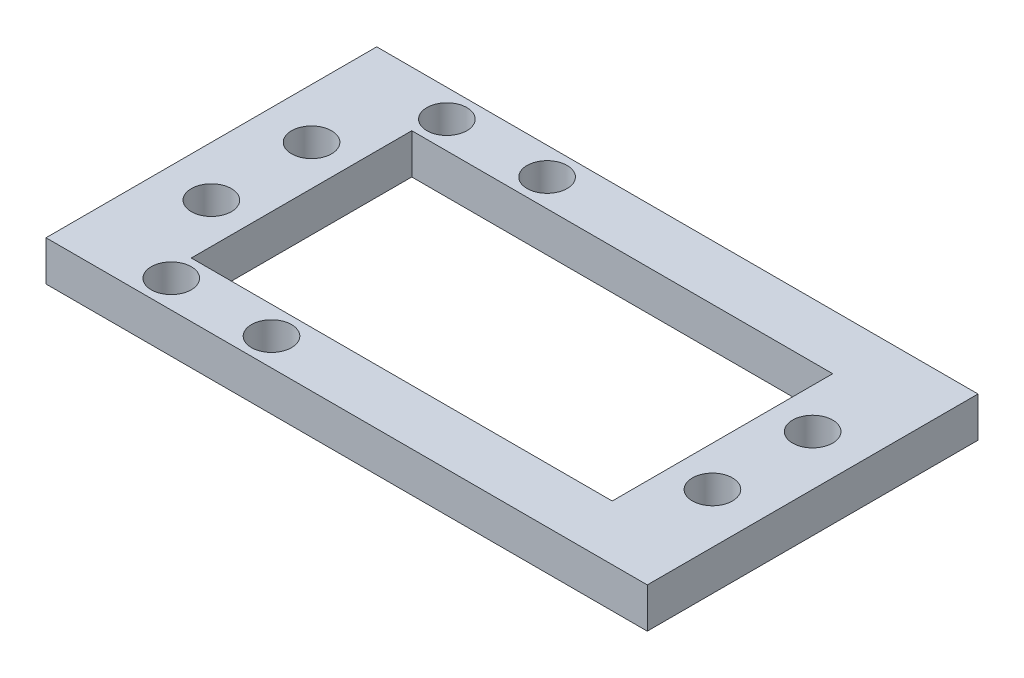
ISO-10303-21;
HEADER;
FILE_DESCRIPTION(('STEP AP214'),'2;1');
FILE_NAME('part.step','',(''),(''),'','','');
FILE_SCHEMA(('AUTOMOTIVE_DESIGN { 1 0 10303 214 1 1 1 1 }'));
ENDSEC;
DATA;
#1=APPLICATION_CONTEXT('core data for automotive mechanical design processes');
#2=APPLICATION_PROTOCOL_DEFINITION('international standard','automotive_design',2000,#1);
#3=PRODUCT_CONTEXT('',#1,'mechanical');
#4=PRODUCT('Part','Part','',(#3));
#5=PRODUCT_RELATED_PRODUCT_CATEGORY('part','',(#4));
#6=PRODUCT_DEFINITION_FORMATION('','',#4);
#7=PRODUCT_DEFINITION_CONTEXT('part definition',#1,'design');
#8=PRODUCT_DEFINITION('design','',#6,#7);
#9=PRODUCT_DEFINITION_SHAPE('','',#8);
#10=(LENGTH_UNIT() NAMED_UNIT(*) SI_UNIT(.MILLI.,.METRE.));
#11=(NAMED_UNIT(*) PLANE_ANGLE_UNIT() SI_UNIT($,.RADIAN.));
#12=(NAMED_UNIT(*) SI_UNIT($,.STERADIAN.) SOLID_ANGLE_UNIT());
#13=UNCERTAINTY_MEASURE_WITH_UNIT(LENGTH_MEASURE(1.E-05),#10,'distance_accuracy_value','');
#14=(GEOMETRIC_REPRESENTATION_CONTEXT(3) GLOBAL_UNCERTAINTY_ASSIGNED_CONTEXT((#13)) GLOBAL_UNIT_ASSIGNED_CONTEXT((#10,
#11,#12)) REPRESENTATION_CONTEXT('',''));
#15=CARTESIAN_POINT('',(0.,0.,0.));
#16=DIRECTION('',(0.,0.,1.));
#17=DIRECTION('',(1.,0.,0.));
#18=AXIS2_PLACEMENT_3D('',#15,#16,#17);
#19=CARTESIAN_POINT('',(32.3540830425261,17.9987562189055,9.));
#20=DIRECTION('',(1.,0.,0.));
#21=DIRECTION('',(0.,0.,-1.));
#22=AXIS2_PLACEMENT_3D('',#19,#20,#21);
#23=PLANE('',#22);
#24=DIRECTION('',(0.,1.,0.));
#25=VECTOR('',#24,1.);
#26=CARTESIAN_POINT('',(32.3540830425261,17.9987562189055,9.));
#27=LINE('',#26,#25);
#28=CARTESIAN_POINT('',(32.3540830425261,27.9987562189055,9.));
#29=VERTEX_POINT('',#28);
#30=CARTESIAN_POINT('',(32.3540830425261,31.9987562189055,9.));
#31=VERTEX_POINT('',#30);
#32=EDGE_CURVE('E42',#29,#31,#27,.T.);
#33=ORIENTED_EDGE('',*,*,#32,.F.);
#34=DIRECTION('',(0.,0.,1.));
#35=VECTOR('',#34,1.);
#36=CARTESIAN_POINT('',(32.3540830425261,27.9987562189055,9.));
#37=LINE('',#36,#35);
#38=CARTESIAN_POINT('',(32.3540830425261,27.9987562189055,31.));
#39=VERTEX_POINT('',#38);
#40=EDGE_CURVE('E56',#29,#39,#37,.T.);
#41=ORIENTED_EDGE('',*,*,#40,.T.);
#42=DIRECTION('',(0.,1.,0.));
#43=VECTOR('',#42,1.);
#44=CARTESIAN_POINT('',(32.3540830425261,17.9987562189055,31.));
#45=LINE('',#44,#43);
#46=CARTESIAN_POINT('',(32.3540830425261,31.9987562189055,31.));
#47=VERTEX_POINT('',#46);
#48=EDGE_CURVE('E11',#39,#47,#45,.T.);
#49=ORIENTED_EDGE('',*,*,#48,.T.);
#50=DIRECTION('',(0.,0.,-1.));
#51=VECTOR('',#50,1.);
#52=CARTESIAN_POINT('',(32.3540830425261,31.9987562189055,31.));
#53=LINE('',#52,#51);
#54=EDGE_CURVE('E162',#47,#31,#53,.T.);
#55=ORIENTED_EDGE('',*,*,#54,.T.);
#56=EDGE_LOOP('',(#33,#41,#49,#55));
#57=FACE_BOUND('',#56,.T.);
#58=ADVANCED_FACE('F39',(#57),#23,.F.);
#59=CARTESIAN_POINT('',(-9.64591695747391,17.9987562189055,31.));
#60=DIRECTION('',(0.,0.,1.));
#61=DIRECTION('',(1.,0.,0.));
#62=AXIS2_PLACEMENT_3D('',#59,#60,#61);
#63=PLANE('',#62);
#64=ORIENTED_EDGE('',*,*,#48,.F.);
#65=DIRECTION('',(-1.,0.,0.));
#66=VECTOR('',#65,1.);
#67=CARTESIAN_POINT('',(-9.64591695747391,27.9987562189055,31.));
#68=LINE('',#67,#66);
#69=CARTESIAN_POINT('',(-9.64591695747391,27.9987562189055,31.));
#70=VERTEX_POINT('',#69);
#71=EDGE_CURVE('E292',#39,#70,#68,.T.);
#72=ORIENTED_EDGE('',*,*,#71,.T.);
#73=DIRECTION('',(0.,1.,0.));
#74=VECTOR('',#73,1.);
#75=CARTESIAN_POINT('',(-9.64591695747391,17.9987562189055,31.));
#76=LINE('',#75,#74);
#77=CARTESIAN_POINT('',(-9.64591695747391,31.9987562189055,31.));
#78=VERTEX_POINT('',#77);
#79=EDGE_CURVE('E48',#70,#78,#76,.T.);
#80=ORIENTED_EDGE('',*,*,#79,.T.);
#81=DIRECTION('',(1.,0.,0.));
#82=VECTOR('',#81,1.);
#83=CARTESIAN_POINT('',(-9.64591695747391,31.9987562189055,31.));
#84=LINE('',#83,#82);
#85=EDGE_CURVE('E166',#78,#47,#84,.T.);
#86=ORIENTED_EDGE('',*,*,#85,.T.);
#87=EDGE_LOOP('',(#64,#72,#80,#86));
#88=FACE_BOUND('',#87,.T.);
#89=ADVANCED_FACE('F220',(#88),#63,.F.);
#90=CARTESIAN_POINT('',(-9.64591695747391,17.9987562189055,9.));
#91=DIRECTION('',(-1.,0.,0.));
#92=DIRECTION('',(0.,0.,1.));
#93=AXIS2_PLACEMENT_3D('',#90,#91,#92);
#94=PLANE('',#93);
#95=ORIENTED_EDGE('',*,*,#79,.F.);
#96=DIRECTION('',(0.,0.,-1.));
#97=VECTOR('',#96,1.);
#98=CARTESIAN_POINT('',(-9.64591695747391,27.9987562189055,9.));
#99=LINE('',#98,#97);
#100=CARTESIAN_POINT('',(-9.64591695747391,27.9987562189055,9.));
#101=VERTEX_POINT('',#100);
#102=EDGE_CURVE('E296',#70,#101,#99,.T.);
#103=ORIENTED_EDGE('',*,*,#102,.T.);
#104=DIRECTION('',(0.,1.,0.));
#105=VECTOR('',#104,1.);
#106=CARTESIAN_POINT('',(-9.64591695747391,17.9987562189055,9.));
#107=LINE('',#106,#105);
#108=CARTESIAN_POINT('',(-9.64591695747391,31.9987562189055,9.));
#109=VERTEX_POINT('',#108);
#110=EDGE_CURVE('E146',#101,#109,#107,.T.);
#111=ORIENTED_EDGE('',*,*,#110,.T.);
#112=DIRECTION('',(0.,0.,1.));
#113=VECTOR('',#112,1.);
#114=CARTESIAN_POINT('',(-9.64591695747391,31.9987562189055,31.));
#115=LINE('',#114,#113);
#116=EDGE_CURVE('E170',#109,#78,#115,.T.);
#117=ORIENTED_EDGE('',*,*,#116,.T.);
#118=EDGE_LOOP('',(#95,#103,#111,#117));
#119=FACE_BOUND('',#118,.T.);
#120=ADVANCED_FACE('F224',(#119),#94,.F.);
#121=CARTESIAN_POINT('',(-9.64591695747391,17.9987562189055,9.));
#122=DIRECTION('',(0.,0.,-1.));
#123=DIRECTION('',(-1.,0.,0.));
#124=AXIS2_PLACEMENT_3D('',#121,#122,#123);
#125=PLANE('',#124);
#126=ORIENTED_EDGE('',*,*,#110,.F.);
#127=DIRECTION('',(1.,0.,0.));
#128=VECTOR('',#127,1.);
#129=CARTESIAN_POINT('',(-9.64591695747391,27.9987562189055,9.));
#130=LINE('',#129,#128);
#131=EDGE_CURVE('E160',#101,#29,#130,.T.);
#132=ORIENTED_EDGE('',*,*,#131,.T.);
#133=ORIENTED_EDGE('',*,*,#32,.T.);
#134=DIRECTION('',(-1.,0.,0.));
#135=VECTOR('',#134,1.);
#136=CARTESIAN_POINT('',(-9.64591695747391,31.9987562189055,9.));
#137=LINE('',#136,#135);
#138=EDGE_CURVE('E158',#31,#109,#137,.T.);
#139=ORIENTED_EDGE('',*,*,#138,.T.);
#140=EDGE_LOOP('',(#126,#132,#133,#139));
#141=FACE_BOUND('',#140,.T.);
#142=ADVANCED_FACE('F156',(#141),#125,.F.);
#143=CARTESIAN_POINT('',(-13.6459169574739,17.9987562189055,15.));
#144=DIRECTION('',(0.,1.,0.));
#145=DIRECTION('',(0.,0.,1.));
#146=AXIS2_PLACEMENT_3D('',#143,#144,#145);
#147=CYLINDRICAL_SURFACE('',#146,2.);
#148=CARTESIAN_POINT('',(-13.6459169574739,27.9987562189055,15.));
#149=DIRECTION('',(0.,1.,0.));
#150=DIRECTION('',(0.,0.,1.));
#151=AXIS2_PLACEMENT_3D('',#148,#149,#150);
#152=CIRCLE('',#151,2.);
#153=CARTESIAN_POINT('',(-13.6459169574739,27.9987562189055,17.));
#154=VERTEX_POINT('',#153);
#155=EDGE_CURVE('E248',#154,#154,#152,.F.);
#156=ORIENTED_EDGE('',*,*,#155,.T.);
#157=EDGE_LOOP('',(#156));
#158=FACE_BOUND('',#157,.T.);
#159=CARTESIAN_POINT('',(-13.6459169574739,31.9987562189055,15.));
#160=DIRECTION('',(0.,1.,0.));
#161=DIRECTION('',(0.,0.,1.));
#162=AXIS2_PLACEMENT_3D('',#159,#160,#161);
#163=CIRCLE('',#162,2.);
#164=CARTESIAN_POINT('',(-13.6459169574739,31.9987562189055,17.));
#165=VERTEX_POINT('',#164);
#166=EDGE_CURVE('E251',#165,#165,#163,.T.);
#167=ORIENTED_EDGE('',*,*,#166,.T.);
#168=EDGE_LOOP('',(#167));
#169=FACE_BOUND('',#168,.T.);
#170=ADVANCED_FACE('F232',(#158,#169),#147,.F.);
#171=CARTESIAN_POINT('',(36.3540830425261,17.9987562189055,25.));
#172=DIRECTION('',(0.,1.,0.));
#173=DIRECTION('',(0.,0.,1.));
#174=AXIS2_PLACEMENT_3D('',#171,#172,#173);
#175=CYLINDRICAL_SURFACE('',#174,2.);
#176=CARTESIAN_POINT('',(36.3540830425261,27.9987562189055,25.));
#177=DIRECTION('',(0.,1.,0.));
#178=DIRECTION('',(0.,0.,1.));
#179=AXIS2_PLACEMENT_3D('',#176,#177,#178);
#180=CIRCLE('',#179,2.);
#181=CARTESIAN_POINT('',(36.3540830425261,27.9987562189055,27.));
#182=VERTEX_POINT('',#181);
#183=EDGE_CURVE('E352',#182,#182,#180,.F.);
#184=ORIENTED_EDGE('',*,*,#183,.T.);
#185=EDGE_LOOP('',(#184));
#186=FACE_BOUND('',#185,.T.);
#187=CARTESIAN_POINT('',(36.3540830425261,31.9987562189055,25.));
#188=DIRECTION('',(0.,1.,0.));
#189=DIRECTION('',(0.,0.,1.));
#190=AXIS2_PLACEMENT_3D('',#187,#188,#189);
#191=CIRCLE('',#190,2.);
#192=CARTESIAN_POINT('',(36.3540830425261,31.9987562189055,27.));
#193=VERTEX_POINT('',#192);
#194=EDGE_CURVE('E271',#193,#193,#191,.T.);
#195=ORIENTED_EDGE('',*,*,#194,.T.);
#196=EDGE_LOOP('',(#195));
#197=FACE_BOUND('',#196,.T.);
#198=ADVANCED_FACE('F238',(#186,#197),#175,.F.);
#199=CARTESIAN_POINT('',(36.3540830425261,17.9987562189055,15.));
#200=DIRECTION('',(0.,1.,0.));
#201=DIRECTION('',(0.,0.,1.));
#202=AXIS2_PLACEMENT_3D('',#199,#200,#201);
#203=CYLINDRICAL_SURFACE('',#202,2.);
#204=CARTESIAN_POINT('',(36.3540830425261,27.9987562189055,15.));
#205=DIRECTION('',(0.,1.,0.));
#206=DIRECTION('',(0.,0.,1.));
#207=AXIS2_PLACEMENT_3D('',#204,#205,#206);
#208=CIRCLE('',#207,2.);
#209=CARTESIAN_POINT('',(36.3540830425261,27.9987562189055,17.));
#210=VERTEX_POINT('',#209);
#211=EDGE_CURVE('E357',#210,#210,#208,.F.);
#212=ORIENTED_EDGE('',*,*,#211,.T.);
#213=EDGE_LOOP('',(#212));
#214=FACE_BOUND('',#213,.T.);
#215=CARTESIAN_POINT('',(36.3540830425261,31.9987562189055,15.));
#216=DIRECTION('',(0.,1.,0.));
#217=DIRECTION('',(0.,0.,1.));
#218=AXIS2_PLACEMENT_3D('',#215,#216,#217);
#219=CIRCLE('',#218,2.);
#220=CARTESIAN_POINT('',(36.3540830425261,31.9987562189055,17.));
#221=VERTEX_POINT('',#220);
#222=EDGE_CURVE('E263',#221,#221,#219,.T.);
#223=ORIENTED_EDGE('',*,*,#222,.T.);
#224=EDGE_LOOP('',(#223));
#225=FACE_BOUND('',#224,.T.);
#226=ADVANCED_FACE('F214',(#214,#225),#203,.F.);
#227=CARTESIAN_POINT('',(-13.6459169574739,17.9987562189055,25.));
#228=DIRECTION('',(0.,1.,0.));
#229=DIRECTION('',(0.,0.,1.));
#230=AXIS2_PLACEMENT_3D('',#227,#228,#229);
#231=CYLINDRICAL_SURFACE('',#230,2.);
#232=CARTESIAN_POINT('',(-13.6459169574739,27.9987562189055,25.));
#233=DIRECTION('',(0.,1.,0.));
#234=DIRECTION('',(0.,0.,1.));
#235=AXIS2_PLACEMENT_3D('',#232,#233,#234);
#236=CIRCLE('',#235,2.);
#237=CARTESIAN_POINT('',(-13.6459169574739,27.9987562189055,27.));
#238=VERTEX_POINT('',#237);
#239=EDGE_CURVE('E355',#238,#238,#236,.F.);
#240=ORIENTED_EDGE('',*,*,#239,.T.);
#241=EDGE_LOOP('',(#240));
#242=FACE_BOUND('',#241,.T.);
#243=CARTESIAN_POINT('',(-13.6459169574739,31.9987562189055,25.));
#244=DIRECTION('',(0.,1.,0.));
#245=DIRECTION('',(0.,0.,1.));
#246=AXIS2_PLACEMENT_3D('',#243,#244,#245);
#247=CIRCLE('',#246,2.);
#248=CARTESIAN_POINT('',(-13.6459169574739,31.9987562189055,27.));
#249=VERTEX_POINT('',#248);
#250=EDGE_CURVE('E255',#249,#249,#247,.T.);
#251=ORIENTED_EDGE('',*,*,#250,.T.);
#252=EDGE_LOOP('',(#251));
#253=FACE_BOUND('',#252,.T.);
#254=ADVANCED_FACE('F207',(#242,#253),#231,.F.);
#255=CARTESIAN_POINT('',(0.,31.9987562189055,0.));
#256=DIRECTION('',(0.,-1.,0.));
#257=DIRECTION('',(0.,0.,-1.));
#258=AXIS2_PLACEMENT_3D('',#255,#256,#257);
#259=PLANE('',#258);
#260=DIRECTION('',(0.,0.,-1.));
#261=VECTOR('',#260,1.);
#262=CARTESIAN_POINT('',(41.3540830425261,31.9987562189055,36.5));
#263=LINE('',#262,#261);
#264=CARTESIAN_POINT('',(41.3540830425261,31.9987562189055,36.5));
#265=VERTEX_POINT('',#264);
#266=CARTESIAN_POINT('',(41.3540830425261,31.9987562189055,3.5));
#267=VERTEX_POINT('',#266);
#268=EDGE_CURVE('E117',#265,#267,#263,.T.);
#269=ORIENTED_EDGE('',*,*,#268,.T.);
#270=DIRECTION('',(-1.,0.,0.));
#271=VECTOR('',#270,1.);
#272=CARTESIAN_POINT('',(-18.6459169574739,31.9987562189055,3.5));
#273=LINE('',#272,#271);
#274=CARTESIAN_POINT('',(-18.6459169574739,31.9987562189055,3.5));
#275=VERTEX_POINT('',#274);
#276=EDGE_CURVE('E188',#267,#275,#273,.T.);
#277=ORIENTED_EDGE('',*,*,#276,.T.);
#278=DIRECTION('',(0.,0.,1.));
#279=VECTOR('',#278,1.);
#280=CARTESIAN_POINT('',(-18.6459169574739,31.9987562189055,36.5));
#281=LINE('',#280,#279);
#282=CARTESIAN_POINT('',(-18.6459169574739,31.9987562189055,36.5));
#283=VERTEX_POINT('',#282);
#284=EDGE_CURVE('E191',#275,#283,#281,.T.);
#285=ORIENTED_EDGE('',*,*,#284,.T.);
#286=DIRECTION('',(1.,0.,0.));
#287=VECTOR('',#286,1.);
#288=CARTESIAN_POINT('',(-18.6459169574739,31.9987562189055,36.5));
#289=LINE('',#288,#287);
#290=EDGE_CURVE('E132',#283,#265,#289,.T.);
#291=ORIENTED_EDGE('',*,*,#290,.T.);
#292=EDGE_LOOP('',(#269,#277,#285,#291));
#293=FACE_BOUND('',#292,.T.);
#294=ORIENTED_EDGE('',*,*,#138,.F.);
#295=ORIENTED_EDGE('',*,*,#54,.F.);
#296=ORIENTED_EDGE('',*,*,#85,.F.);
#297=ORIENTED_EDGE('',*,*,#116,.F.);
#298=EDGE_LOOP('',(#294,#295,#296,#297));
#299=FACE_BOUND('',#298,.T.);
#300=CARTESIAN_POINT('',(-8.89591695747391,31.9987562189055,6.25));
#301=DIRECTION('',(0.,1.,0.));
#302=DIRECTION('',(0.,0.,1.));
#303=AXIS2_PLACEMENT_3D('',#300,#301,#302);
#304=CIRCLE('',#303,2.);
#305=CARTESIAN_POINT('',(-8.89591695747391,31.9987562189055,8.25));
#306=VERTEX_POINT('',#305);
#307=EDGE_CURVE('E172',#306,#306,#304,.T.);
#308=ORIENTED_EDGE('',*,*,#307,.F.);
#309=EDGE_LOOP('',(#308));
#310=FACE_BOUND('',#309,.T.);
#311=CARTESIAN_POINT('',(-8.89591695747391,31.9987562189055,33.75));
#312=DIRECTION('',(0.,1.,0.));
#313=DIRECTION('',(0.,0.,-1.));
#314=AXIS2_PLACEMENT_3D('',#311,#312,#313);
#315=CIRCLE('',#314,2.);
#316=CARTESIAN_POINT('',(-8.89591695747391,31.9987562189055,31.75));
#317=VERTEX_POINT('',#316);
#318=EDGE_CURVE('E178',#317,#317,#315,.T.);
#319=ORIENTED_EDGE('',*,*,#318,.F.);
#320=EDGE_LOOP('',(#319));
#321=FACE_BOUND('',#320,.T.);
#322=CARTESIAN_POINT('',(1.10408304252609,31.9987562189055,6.25));
#323=DIRECTION('',(0.,1.,0.));
#324=DIRECTION('',(0.,0.,1.));
#325=AXIS2_PLACEMENT_3D('',#322,#323,#324);
#326=CIRCLE('',#325,2.);
#327=CARTESIAN_POINT('',(1.10408304252609,31.9987562189055,8.25));
#328=VERTEX_POINT('',#327);
#329=EDGE_CURVE('E260',#328,#328,#326,.T.);
#330=ORIENTED_EDGE('',*,*,#329,.F.);
#331=EDGE_LOOP('',(#330));
#332=FACE_BOUND('',#331,.T.);
#333=CARTESIAN_POINT('',(1.10408304252609,31.9987562189055,33.75));
#334=DIRECTION('',(0.,1.,0.));
#335=DIRECTION('',(0.,0.,-1.));
#336=AXIS2_PLACEMENT_3D('',#333,#334,#335);
#337=CIRCLE('',#336,2.);
#338=CARTESIAN_POINT('',(1.10408304252609,31.9987562189055,31.75));
#339=VERTEX_POINT('',#338);
#340=EDGE_CURVE('E254',#339,#339,#337,.T.);
#341=ORIENTED_EDGE('',*,*,#340,.F.);
#342=EDGE_LOOP('',(#341));
#343=FACE_BOUND('',#342,.T.);
#344=ORIENTED_EDGE('',*,*,#166,.F.);
#345=EDGE_LOOP('',(#344));
#346=FACE_BOUND('',#345,.T.);
#347=ORIENTED_EDGE('',*,*,#250,.F.);
#348=EDGE_LOOP('',(#347));
#349=FACE_BOUND('',#348,.T.);
#350=ORIENTED_EDGE('',*,*,#222,.F.);
#351=EDGE_LOOP('',(#350));
#352=FACE_BOUND('',#351,.T.);
#353=ORIENTED_EDGE('',*,*,#194,.F.);
#354=EDGE_LOOP('',(#353));
#355=FACE_BOUND('',#354,.T.);
#356=ADVANCED_FACE('F168',(#293,#299,#310,#321,#332,#343,#346,#349,#352,#355),#259,.F.);
#357=CARTESIAN_POINT('',(41.3540830425261,31.9987562189055,36.5));
#358=DIRECTION('',(-1.,0.,0.));
#359=DIRECTION('',(0.,0.,1.));
#360=AXIS2_PLACEMENT_3D('',#357,#358,#359);
#361=PLANE('',#360);
#362=DIRECTION('',(0.,0.,-1.));
#363=VECTOR('',#362,1.);
#364=CARTESIAN_POINT('',(41.3540830425261,27.9987562189055,36.5));
#365=LINE('',#364,#363);
#366=CARTESIAN_POINT('',(41.3540830425261,27.9987562189055,36.5));
#367=VERTEX_POINT('',#366);
#368=CARTESIAN_POINT('',(41.3540830425261,27.9987562189055,3.5));
#369=VERTEX_POINT('',#368);
#370=EDGE_CURVE('E111',#367,#369,#365,.T.);
#371=ORIENTED_EDGE('',*,*,#370,.T.);
#372=DIRECTION('',(0.,-1.,0.));
#373=VECTOR('',#372,1.);
#374=CARTESIAN_POINT('',(41.3540830425261,31.9987562189055,3.5));
#375=LINE('',#374,#373);
#376=EDGE_CURVE('E138',#267,#369,#375,.T.);
#377=ORIENTED_EDGE('',*,*,#376,.F.);
#378=ORIENTED_EDGE('',*,*,#268,.F.);
#379=DIRECTION('',(0.,-1.,0.));
#380=VECTOR('',#379,1.);
#381=CARTESIAN_POINT('',(41.3540830425261,31.9987562189055,36.5));
#382=LINE('',#381,#380);
#383=EDGE_CURVE('E134',#265,#367,#382,.T.);
#384=ORIENTED_EDGE('',*,*,#383,.T.);
#385=EDGE_LOOP('',(#371,#377,#378,#384));
#386=FACE_BOUND('',#385,.T.);
#387=ADVANCED_FACE('F204',(#386),#361,.F.);
#388=CARTESIAN_POINT('',(-18.6459169574739,31.9987562189055,3.5));
#389=DIRECTION('',(0.,0.,1.));
#390=DIRECTION('',(1.,0.,0.));
#391=AXIS2_PLACEMENT_3D('',#388,#389,#390);
#392=PLANE('',#391);
#393=DIRECTION('',(-1.,0.,0.));
#394=VECTOR('',#393,1.);
#395=CARTESIAN_POINT('',(-18.6459169574739,27.9987562189055,3.5));
#396=LINE('',#395,#394);
#397=CARTESIAN_POINT('',(-18.6459169574739,27.9987562189055,3.5));
#398=VERTEX_POINT('',#397);
#399=EDGE_CURVE('E129',#369,#398,#396,.T.);
#400=ORIENTED_EDGE('',*,*,#399,.T.);
#401=DIRECTION('',(0.,-1.,0.));
#402=VECTOR('',#401,1.);
#403=CARTESIAN_POINT('',(-18.6459169574739,31.9987562189055,3.5));
#404=LINE('',#403,#402);
#405=EDGE_CURVE('E127',#275,#398,#404,.T.);
#406=ORIENTED_EDGE('',*,*,#405,.F.);
#407=ORIENTED_EDGE('',*,*,#276,.F.);
#408=ORIENTED_EDGE('',*,*,#376,.T.);
#409=EDGE_LOOP('',(#400,#406,#407,#408));
#410=FACE_BOUND('',#409,.T.);
#411=ADVANCED_FACE('F200',(#410),#392,.F.);
#412=CARTESIAN_POINT('',(-18.6459169574739,31.9987562189055,36.5));
#413=DIRECTION('',(1.,0.,0.));
#414=DIRECTION('',(0.,0.,-1.));
#415=AXIS2_PLACEMENT_3D('',#412,#413,#414);
#416=PLANE('',#415);
#417=DIRECTION('',(0.,0.,1.));
#418=VECTOR('',#417,1.);
#419=CARTESIAN_POINT('',(-18.6459169574739,27.9987562189055,36.5));
#420=LINE('',#419,#418);
#421=CARTESIAN_POINT('',(-18.6459169574739,27.9987562189055,36.5));
#422=VERTEX_POINT('',#421);
#423=EDGE_CURVE('E108',#398,#422,#420,.T.);
#424=ORIENTED_EDGE('',*,*,#423,.T.);
#425=DIRECTION('',(0.,-1.,0.));
#426=VECTOR('',#425,1.);
#427=CARTESIAN_POINT('',(-18.6459169574739,31.9987562189055,36.5));
#428=LINE('',#427,#426);
#429=EDGE_CURVE('E124',#283,#422,#428,.T.);
#430=ORIENTED_EDGE('',*,*,#429,.F.);
#431=ORIENTED_EDGE('',*,*,#284,.F.);
#432=ORIENTED_EDGE('',*,*,#405,.T.);
#433=EDGE_LOOP('',(#424,#430,#431,#432));
#434=FACE_BOUND('',#433,.T.);
#435=ADVANCED_FACE('F122',(#434),#416,.F.);
#436=CARTESIAN_POINT('',(-18.6459169574739,31.9987562189055,36.5));
#437=DIRECTION('',(0.,0.,-1.));
#438=DIRECTION('',(-1.,0.,0.));
#439=AXIS2_PLACEMENT_3D('',#436,#437,#438);
#440=PLANE('',#439);
#441=DIRECTION('',(1.,0.,0.));
#442=VECTOR('',#441,1.);
#443=CARTESIAN_POINT('',(-18.6459169574739,27.9987562189055,36.5));
#444=LINE('',#443,#442);
#445=EDGE_CURVE('E104',#422,#367,#444,.T.);
#446=ORIENTED_EDGE('',*,*,#445,.T.);
#447=ORIENTED_EDGE('',*,*,#383,.F.);
#448=ORIENTED_EDGE('',*,*,#290,.F.);
#449=ORIENTED_EDGE('',*,*,#429,.T.);
#450=EDGE_LOOP('',(#446,#447,#448,#449));
#451=FACE_BOUND('',#450,.T.);
#452=ADVANCED_FACE('F131',(#451),#440,.F.);
#453=CARTESIAN_POINT('',(-8.89591695747391,31.9987562189055,6.25));
#454=DIRECTION('',(0.,-1.,0.));
#455=DIRECTION('',(0.,0.,-1.));
#456=AXIS2_PLACEMENT_3D('',#453,#454,#455);
#457=CYLINDRICAL_SURFACE('',#456,2.);
#458=ORIENTED_EDGE('',*,*,#307,.T.);
#459=EDGE_LOOP('',(#458));
#460=FACE_BOUND('',#459,.T.);
#461=CARTESIAN_POINT('',(-8.89591695747391,27.9987562189055,6.25));
#462=DIRECTION('',(0.,1.,0.));
#463=DIRECTION('',(0.,0.,1.));
#464=AXIS2_PLACEMENT_3D('',#461,#462,#463);
#465=CIRCLE('',#464,2.);
#466=CARTESIAN_POINT('',(-8.89591695747391,27.9987562189055,8.25));
#467=VERTEX_POINT('',#466);
#468=EDGE_CURVE('E181',#467,#467,#465,.T.);
#469=ORIENTED_EDGE('',*,*,#468,.F.);
#470=EDGE_LOOP('',(#469));
#471=FACE_BOUND('',#470,.T.);
#472=ADVANCED_FACE('F320',(#460,#471),#457,.F.);
#473=CARTESIAN_POINT('',(-8.89591695747391,31.9987562189055,33.75));
#474=DIRECTION('',(0.,-1.,0.));
#475=DIRECTION('',(0.,0.,-1.));
#476=AXIS2_PLACEMENT_3D('',#473,#474,#475);
#477=CYLINDRICAL_SURFACE('',#476,2.);
#478=ORIENTED_EDGE('',*,*,#318,.T.);
#479=EDGE_LOOP('',(#478));
#480=FACE_BOUND('',#479,.T.);
#481=CARTESIAN_POINT('',(-8.89591695747391,27.9987562189055,33.75));
#482=DIRECTION('',(0.,1.,0.));
#483=DIRECTION('',(0.,0.,-1.));
#484=AXIS2_PLACEMENT_3D('',#481,#482,#483);
#485=CIRCLE('',#484,2.);
#486=CARTESIAN_POINT('',(-8.89591695747391,27.9987562189055,31.75));
#487=VERTEX_POINT('',#486);
#488=EDGE_CURVE('E279',#487,#487,#485,.T.);
#489=ORIENTED_EDGE('',*,*,#488,.F.);
#490=EDGE_LOOP('',(#489));
#491=FACE_BOUND('',#490,.T.);
#492=ADVANCED_FACE('F324',(#480,#491),#477,.F.);
#493=CARTESIAN_POINT('',(1.10408304252609,31.9987562189055,6.25));
#494=DIRECTION('',(0.,-1.,0.));
#495=DIRECTION('',(0.,0.,-1.));
#496=AXIS2_PLACEMENT_3D('',#493,#494,#495);
#497=CYLINDRICAL_SURFACE('',#496,2.);
#498=ORIENTED_EDGE('',*,*,#329,.T.);
#499=EDGE_LOOP('',(#498));
#500=FACE_BOUND('',#499,.T.);
#501=CARTESIAN_POINT('',(1.10408304252609,27.9987562189055,6.25));
#502=DIRECTION('',(0.,1.,0.));
#503=DIRECTION('',(0.,0.,1.));
#504=AXIS2_PLACEMENT_3D('',#501,#502,#503);
#505=CIRCLE('',#504,2.);
#506=CARTESIAN_POINT('',(1.10408304252609,27.9987562189055,8.25));
#507=VERTEX_POINT('',#506);
#508=EDGE_CURVE('E272',#507,#507,#505,.T.);
#509=ORIENTED_EDGE('',*,*,#508,.F.);
#510=EDGE_LOOP('',(#509));
#511=FACE_BOUND('',#510,.T.);
#512=ADVANCED_FACE('F329',(#500,#511),#497,.F.);
#513=CARTESIAN_POINT('',(1.10408304252609,31.9987562189055,33.75));
#514=DIRECTION('',(0.,-1.,0.));
#515=DIRECTION('',(0.,0.,-1.));
#516=AXIS2_PLACEMENT_3D('',#513,#514,#515);
#517=CYLINDRICAL_SURFACE('',#516,2.);
#518=ORIENTED_EDGE('',*,*,#340,.T.);
#519=EDGE_LOOP('',(#518));
#520=FACE_BOUND('',#519,.T.);
#521=CARTESIAN_POINT('',(1.10408304252609,27.9987562189055,33.75));
#522=DIRECTION('',(0.,1.,0.));
#523=DIRECTION('',(0.,0.,-1.));
#524=AXIS2_PLACEMENT_3D('',#521,#522,#523);
#525=CIRCLE('',#524,2.);
#526=CARTESIAN_POINT('',(1.10408304252609,27.9987562189055,31.75));
#527=VERTEX_POINT('',#526);
#528=EDGE_CURVE('E267',#527,#527,#525,.T.);
#529=ORIENTED_EDGE('',*,*,#528,.F.);
#530=EDGE_LOOP('',(#529));
#531=FACE_BOUND('',#530,.T.);
#532=ADVANCED_FACE('F336',(#520,#531),#517,.F.);
#533=CARTESIAN_POINT('',(-35.1459169574739,27.9987562189055,0.));
#534=DIRECTION('',(0.,1.,0.));
#535=DIRECTION('',(0.,0.,1.));
#536=AXIS2_PLACEMENT_3D('',#533,#534,#535);
#537=PLANE('',#536);
#538=ORIENTED_EDGE('',*,*,#528,.T.);
#539=EDGE_LOOP('',(#538));
#540=FACE_BOUND('',#539,.T.);
#541=ORIENTED_EDGE('',*,*,#508,.T.);
#542=EDGE_LOOP('',(#541));
#543=FACE_BOUND('',#542,.T.);
#544=ORIENTED_EDGE('',*,*,#488,.T.);
#545=EDGE_LOOP('',(#544));
#546=FACE_BOUND('',#545,.T.);
#547=ORIENTED_EDGE('',*,*,#468,.T.);
#548=EDGE_LOOP('',(#547));
#549=FACE_BOUND('',#548,.T.);
#550=ORIENTED_EDGE('',*,*,#183,.F.);
#551=EDGE_LOOP('',(#550));
#552=FACE_BOUND('',#551,.T.);
#553=ORIENTED_EDGE('',*,*,#239,.F.);
#554=EDGE_LOOP('',(#553));
#555=FACE_BOUND('',#554,.T.);
#556=ORIENTED_EDGE('',*,*,#445,.F.);
#557=ORIENTED_EDGE('',*,*,#423,.F.);
#558=ORIENTED_EDGE('',*,*,#399,.F.);
#559=ORIENTED_EDGE('',*,*,#370,.F.);
#560=EDGE_LOOP('',(#556,#557,#558,#559));
#561=FACE_BOUND('',#560,.T.);
#562=ORIENTED_EDGE('',*,*,#211,.F.);
#563=EDGE_LOOP('',(#562));
#564=FACE_BOUND('',#563,.T.);
#565=ORIENTED_EDGE('',*,*,#155,.F.);
#566=EDGE_LOOP('',(#565));
#567=FACE_BOUND('',#566,.T.);
#568=ORIENTED_EDGE('',*,*,#131,.F.);
#569=ORIENTED_EDGE('',*,*,#102,.F.);
#570=ORIENTED_EDGE('',*,*,#71,.F.);
#571=ORIENTED_EDGE('',*,*,#40,.F.);
#572=EDGE_LOOP('',(#568,#569,#570,#571));
#573=FACE_BOUND('',#572,.T.);
#574=ADVANCED_FACE('F106',(#540,#543,#546,#549,#552,#555,#561,#564,#567,#573),#537,.F.);
#575=CLOSED_SHELL('',(#58,#89,#120,#142,#170,#198,#226,#254,#356,#387,#411,#435,#452,#472,#492,
#512,#532,#574));
#576=MANIFOLD_SOLID_BREP('B2',#575);
#577=ADVANCED_BREP_SHAPE_REPRESENTATION('',(#18,#576),#14);
#578=SHAPE_DEFINITION_REPRESENTATION(#9,#577);
ENDSEC;
END-ISO-10303-21;
